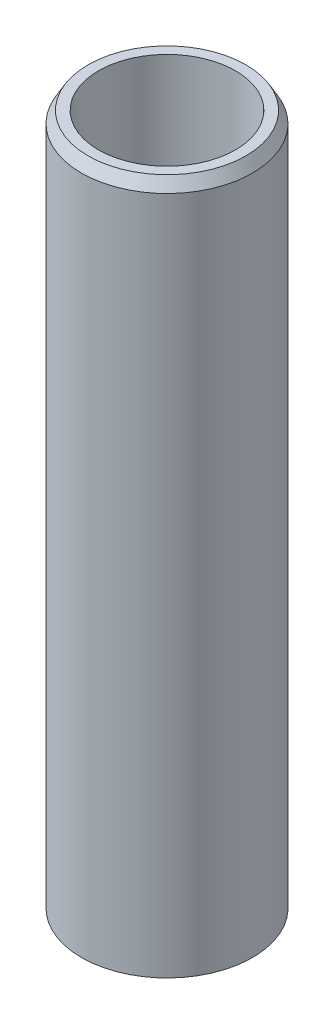
ISO-10303-21;
HEADER;
FILE_DESCRIPTION(('STEP AP214'),'2;1');
FILE_NAME('part.step','',(''),(''),'','','');
FILE_SCHEMA(('AUTOMOTIVE_DESIGN { 1 0 10303 214 1 1 1 1 }'));
ENDSEC;
DATA;
#1=APPLICATION_CONTEXT('core data for automotive mechanical design processes');
#2=APPLICATION_PROTOCOL_DEFINITION('international standard','automotive_design',2000,#1);
#3=PRODUCT_CONTEXT('',#1,'mechanical');
#4=PRODUCT('Part','Part','',(#3));
#5=PRODUCT_RELATED_PRODUCT_CATEGORY('part','',(#4));
#6=PRODUCT_DEFINITION_FORMATION('','',#4);
#7=PRODUCT_DEFINITION_CONTEXT('part definition',#1,'design');
#8=PRODUCT_DEFINITION('design','',#6,#7);
#9=PRODUCT_DEFINITION_SHAPE('','',#8);
#10=(LENGTH_UNIT() NAMED_UNIT(*) SI_UNIT(.MILLI.,.METRE.));
#11=(NAMED_UNIT(*) PLANE_ANGLE_UNIT() SI_UNIT($,.RADIAN.));
#12=(NAMED_UNIT(*) SI_UNIT($,.STERADIAN.) SOLID_ANGLE_UNIT());
#13=UNCERTAINTY_MEASURE_WITH_UNIT(LENGTH_MEASURE(1.E-05),#10,'distance_accuracy_value','');
#14=(GEOMETRIC_REPRESENTATION_CONTEXT(3) GLOBAL_UNCERTAINTY_ASSIGNED_CONTEXT((#13)) GLOBAL_UNIT_ASSIGNED_CONTEXT((#10,
#11,#12)) REPRESENTATION_CONTEXT('',''));
#15=CARTESIAN_POINT('',(0.,0.,0.));
#16=DIRECTION('',(0.,0.,1.));
#17=DIRECTION('',(1.,0.,0.));
#18=AXIS2_PLACEMENT_3D('',#15,#16,#17);
#19=CARTESIAN_POINT('',(0.,224.148766659755,0.));
#20=DIRECTION('',(0.,-1.,0.));
#21=DIRECTION('',(0.,0.,-1.));
#22=AXIS2_PLACEMENT_3D('',#19,#20,#21);
#23=CYLINDRICAL_SURFACE('',#22,27.5);
#24=CARTESIAN_POINT('',(0.,220.432979597929,0.));
#25=DIRECTION('',(0.,1.,0.));
#26=DIRECTION('',(0.,0.,1.));
#27=AXIS2_PLACEMENT_3D('',#24,#25,#26);
#28=CIRCLE('',#27,27.5);
#29=CARTESIAN_POINT('',(0.,220.432979597929,-27.5));
#30=VERTEX_POINT('',#29);
#31=EDGE_CURVE('E50',#30,#30,#28,.F.);
#32=ORIENTED_EDGE('',*,*,#31,.T.);
#33=EDGE_LOOP('',(#32));
#34=FACE_BOUND('',#33,.T.);
#35=CARTESIAN_POINT('',(0.,2.14531066039669,0.));
#36=DIRECTION('',(0.,1.,0.));
#37=DIRECTION('',(0.,0.,1.));
#38=AXIS2_PLACEMENT_3D('',#35,#36,#37);
#39=CIRCLE('',#38,27.5);
#40=CARTESIAN_POINT('',(0.,2.14531066039669,27.5));
#41=VERTEX_POINT('',#40);
#42=EDGE_CURVE('E51',#41,#41,#39,.T.);
#43=ORIENTED_EDGE('',*,*,#42,.T.);
#44=EDGE_LOOP('',(#43));
#45=FACE_BOUND('',#44,.T.);
#46=ADVANCED_FACE('F39',(#34,#45),#23,.T.);
#47=CARTESIAN_POINT('',(0.,224.148766659755,0.));
#48=DIRECTION('',(0.,1.,0.));
#49=DIRECTION('',(0.,0.,1.));
#50=AXIS2_PLACEMENT_3D('',#47,#48,#49);
#51=PLANE('',#50);
#52=CARTESIAN_POINT('',(0.,224.148766659755,0.));
#53=DIRECTION('',(0.,1.,0.));
#54=DIRECTION('',(0.,0.,1.));
#55=AXIS2_PLACEMENT_3D('',#52,#53,#54);
#56=CIRCLE('',#55,25.3546893396034);
#57=CARTESIAN_POINT('',(0.,224.148766659755,-25.3546893396034));
#58=VERTEX_POINT('',#57);
#59=EDGE_CURVE('E54',#58,#58,#56,.T.);
#60=ORIENTED_EDGE('',*,*,#59,.T.);
#61=EDGE_LOOP('',(#60));
#62=FACE_BOUND('',#61,.T.);
#63=CARTESIAN_POINT('',(0.,224.148766659755,0.));
#64=DIRECTION('',(0.,1.,0.));
#65=DIRECTION('',(0.,0.,1.));
#66=AXIS2_PLACEMENT_3D('',#63,#64,#65);
#67=CIRCLE('',#66,22.0198346409254);
#68=CARTESIAN_POINT('',(0.,224.148766659755,22.0198346409254));
#69=VERTEX_POINT('',#68);
#70=EDGE_CURVE('E58',#69,#69,#67,.T.);
#71=ORIENTED_EDGE('',*,*,#70,.F.);
#72=EDGE_LOOP('',(#71));
#73=FACE_BOUND('',#72,.T.);
#74=ADVANCED_FACE('F69',(#62,#73),#51,.T.);
#75=CARTESIAN_POINT('',(0.,0.,0.));
#76=DIRECTION('',(0.,1.,0.));
#77=DIRECTION('',(0.,0.,1.));
#78=AXIS2_PLACEMENT_3D('',#75,#76,#77);
#79=PLANE('',#78);
#80=CARTESIAN_POINT('',(0.,0.,0.));
#81=DIRECTION('',(0.,1.,0.));
#82=DIRECTION('',(0.,0.,1.));
#83=AXIS2_PLACEMENT_3D('',#80,#81,#82);
#84=CIRCLE('',#83,23.7842129381738);
#85=CARTESIAN_POINT('',(0.,0.,23.7842129381738));
#86=VERTEX_POINT('',#85);
#87=EDGE_CURVE('E10',#86,#86,#84,.F.);
#88=ORIENTED_EDGE('',*,*,#87,.T.);
#89=EDGE_LOOP('',(#88));
#90=FACE_BOUND('',#89,.T.);
#91=CARTESIAN_POINT('',(0.,0.,0.));
#92=DIRECTION('',(0.,1.,0.));
#93=DIRECTION('',(0.,0.,1.));
#94=AXIS2_PLACEMENT_3D('',#91,#92,#93);
#95=CIRCLE('',#94,22.0198346409254);
#96=CARTESIAN_POINT('',(0.,0.,22.0198346409254));
#97=VERTEX_POINT('',#96);
#98=EDGE_CURVE('E63',#97,#97,#95,.T.);
#99=ORIENTED_EDGE('',*,*,#98,.T.);
#100=EDGE_LOOP('',(#99));
#101=FACE_BOUND('',#100,.T.);
#102=ADVANCED_FACE('F75',(#90,#101),#79,.F.);
#103=CARTESIAN_POINT('',(0.,224.148766659755,0.));
#104=DIRECTION('',(0.,-1.,0.));
#105=DIRECTION('',(0.,0.,-1.));
#106=AXIS2_PLACEMENT_3D('',#103,#104,#105);
#107=CYLINDRICAL_SURFACE('',#106,22.0198346409254);
#108=ORIENTED_EDGE('',*,*,#70,.T.);
#109=EDGE_LOOP('',(#108));
#110=FACE_BOUND('',#109,.T.);
#111=ORIENTED_EDGE('',*,*,#98,.F.);
#112=EDGE_LOOP('',(#111));
#113=FACE_BOUND('',#112,.T.);
#114=ADVANCED_FACE('F70',(#110,#113),#107,.F.);
#115=CARTESIAN_POINT('',(0.,224.148766659755,0.));
#116=DIRECTION('',(0.,-1.,0.));
#117=DIRECTION('',(0.,0.,-1.));
#118=AXIS2_PLACEMENT_3D('',#115,#116,#117);
#119=CONICAL_SURFACE('',#118,25.3546893396034,0.52359877559829);
#120=CARTESIAN_POINT('',(0.,220.432979597929,-27.5));
#121=CARTESIAN_POINT('',(0.,220.471685713156,-27.4776530139542));
#122=CARTESIAN_POINT('',(0.,220.510391828383,-27.4553060279084));
#123=CARTESIAN_POINT('',(0.,220.587804058838,-27.4106120558168));
#124=CARTESIAN_POINT('',(0.,220.626510174065,-27.388265069771));
#125=CARTESIAN_POINT('',(0.,220.70392240452,-27.3435710976794));
#126=CARTESIAN_POINT('',(0.,220.742628519747,-27.3212241116336));
#127=CARTESIAN_POINT('',(0.,220.820040750202,-27.276530139542));
#128=CARTESIAN_POINT('',(0.,220.85874686543,-27.2541831534962));
#129=CARTESIAN_POINT('',(0.,220.936159095884,-27.2094891814046));
#130=CARTESIAN_POINT('',(0.,220.974865211112,-27.1871421953588));
#131=CARTESIAN_POINT('',(0.,221.052277441566,-27.1424482232672));
#132=CARTESIAN_POINT('',(0.,221.090983556794,-27.1201012372214));
#133=CARTESIAN_POINT('',(0.,221.168395787248,-27.0754072651298));
#134=CARTESIAN_POINT('',(0.,221.207101902476,-27.053060279084));
#135=CARTESIAN_POINT('',(0.,221.28451413293,-27.0083663069924));
#136=CARTESIAN_POINT('',(0.,221.323220248158,-26.9860193209466));
#137=CARTESIAN_POINT('',(0.,221.400632478613,-26.9413253488551));
#138=CARTESIAN_POINT('',(0.,221.43933859384,-26.9189783628093));
#139=CARTESIAN_POINT('',(0.,221.516750824295,-26.8742843907177));
#140=CARTESIAN_POINT('',(0.,221.555456939522,-26.8519374046719));
#141=CARTESIAN_POINT('',(0.,221.632869169977,-26.8072434325803));
#142=CARTESIAN_POINT('',(0.,221.671575285204,-26.7848964465345));
#143=CARTESIAN_POINT('',(0.,221.748987515659,-26.7402024744429));
#144=CARTESIAN_POINT('',(0.,221.787693630886,-26.7178554883971));
#145=CARTESIAN_POINT('',(0.,221.865105861341,-26.6731615163055));
#146=CARTESIAN_POINT('',(0.,221.903811976568,-26.6508145302597));
#147=CARTESIAN_POINT('',(0.,221.981224207023,-26.6061205581681));
#148=CARTESIAN_POINT('',(0.,222.01993032225,-26.5837735721223));
#149=CARTESIAN_POINT('',(0.,222.097342552705,-26.5390796000307));
#150=CARTESIAN_POINT('',(0.,222.136048667932,-26.5167326139849));
#151=CARTESIAN_POINT('',(0.,222.213460898387,-26.4720386418933));
#152=CARTESIAN_POINT('',(0.,222.252167013614,-26.4496916558475));
#153=CARTESIAN_POINT('',(0.,222.329579244069,-26.4049976837559));
#154=CARTESIAN_POINT('',(0.,222.368285359296,-26.3826506977101));
#155=CARTESIAN_POINT('',(0.,222.445697589751,-26.3379567256185));
#156=CARTESIAN_POINT('',(0.,222.484403704979,-26.3156097395727));
#157=CARTESIAN_POINT('',(0.,222.561815935433,-26.2709157674811));
#158=CARTESIAN_POINT('',(0.,222.600522050661,-26.2485687814353));
#159=CARTESIAN_POINT('',(0.,222.677934281115,-26.2038748093437));
#160=CARTESIAN_POINT('',(0.,222.716640396343,-26.1815278232979));
#161=CARTESIAN_POINT('',(0.,222.794052626797,-26.1368338512063));
#162=CARTESIAN_POINT('',(0.,222.832758742025,-26.1144868651605));
#163=CARTESIAN_POINT('',(0.,222.910170972479,-26.0697928930689));
#164=CARTESIAN_POINT('',(0.,222.948877087707,-26.0474459070231));
#165=CARTESIAN_POINT('',(0.,223.026289318162,-26.0027519349315));
#166=CARTESIAN_POINT('',(0.,223.064995433389,-25.9804049488857));
#167=CARTESIAN_POINT('',(0.,223.142407663844,-25.9357109767941));
#168=CARTESIAN_POINT('',(0.,223.181113779071,-25.9133639907483));
#169=CARTESIAN_POINT('',(0.,223.258526009526,-25.8686700186567));
#170=CARTESIAN_POINT('',(0.,223.297232124753,-25.8463230326109));
#171=CARTESIAN_POINT('',(0.,223.374644355208,-25.8016290605193));
#172=CARTESIAN_POINT('',(0.,223.413350470435,-25.7792820744735));
#173=CARTESIAN_POINT('',(0.,223.49076270089,-25.7345881023819));
#174=CARTESIAN_POINT('',(0.,223.529468816117,-25.7122411163361));
#175=CARTESIAN_POINT('',(0.,223.606881046572,-25.6675471442445));
#176=CARTESIAN_POINT('',(0.,223.645587161799,-25.6452001581987));
#177=CARTESIAN_POINT('',(0.,223.722999392254,-25.6005061861072));
#178=CARTESIAN_POINT('',(0.,223.761705507481,-25.5781592000614));
#179=CARTESIAN_POINT('',(0.,223.839117737936,-25.5334652279698));
#180=CARTESIAN_POINT('',(0.,223.877823853163,-25.511118241924));
#181=CARTESIAN_POINT('',(0.,223.955236083618,-25.4664242698324));
#182=CARTESIAN_POINT('',(0.,223.993942198845,-25.4440772837866));
#183=CARTESIAN_POINT('',(0.,224.0713544293,-25.399383311695));
#184=CARTESIAN_POINT('',(0.,224.110060544527,-25.3770363256492));
#185=CARTESIAN_POINT('',(0.,224.148766659755,-25.3546893396034));
#186=B_SPLINE_CURVE_WITH_KNOTS('',3,(#120,#121,#122,#123,#124,#125,#126,#127,#128,#129,#130,
#131,#132,#133,#134,#135,#136,#137,#138,#139,#140,#141,#142,#143,#144,#145,#146,#147,#148,#149,
#150,#151,#152,#153,#154,#155,#156,#157,#158,#159,#160,#161,#162,#163,#164,#165,#166,#167,#168,
#169,#170,#171,#172,#173,#174,#175,#176,#177,#178,#179,#180,#181,#182,#183,#184,#185),
.UNSPECIFIED.,.F.,.F.,(4,2,2,2,2,2,2,2,2,2,2,2,2,2,2,2,2,2,2,2,2,2,2,2,2,2,2,2,2,2,2,2,4),(0.,
0.134081916274788,0.268163832549577,0.402245748824365,0.536327665099154,0.670409581373944,
0.804491497648731,0.938573413923545,1.07265533019833,1.20673724647312,1.34081916274791,
1.4749010790227,1.60898299529749,1.7430649115723,1.87714682784709,2.01122874412188,
2.14531066039667,2.27939257667145,2.41347449294624,2.54755640922103,2.68163832549584,
2.81572024177063,2.94980215804542,3.08388407432021,3.217965990595,3.35204790686979,
3.4861298231446,3.62021173941939,3.75429365569418,3.88837557196897,4.02245748824376,
4.15653940451854,4.29062132079336),.UNSPECIFIED.);
#187=EDGE_CURVE('BSEAM81',#30,#58,#186,.T.);
#188=ORIENTED_EDGE('',*,*,#31,.F.);
#189=ORIENTED_EDGE('',*,*,#59,.F.);
#190=ORIENTED_EDGE('',*,*,#187,.T.);
#191=ORIENTED_EDGE('',*,*,#187,.F.);
#192=EDGE_LOOP('',(#188,#190,#189,#191));
#193=FACE_BOUND('',#192,.T.);
#194=ADVANCED_FACE('F81',(#193),#119,.T.);
#195=CARTESIAN_POINT('',(0.,2.14531066039669,0.));
#196=DIRECTION('',(0.,1.,0.));
#197=DIRECTION('',(0.,0.,1.));
#198=AXIS2_PLACEMENT_3D('',#195,#196,#197);
#199=CONICAL_SURFACE('',#198,27.5,1.0471975511966);
#200=ORIENTED_EDGE('',*,*,#87,.F.);
#201=EDGE_LOOP('',(#200));
#202=FACE_BOUND('',#201,.T.);
#203=ORIENTED_EDGE('',*,*,#42,.F.);
#204=EDGE_LOOP('',(#203));
#205=FACE_BOUND('',#204,.T.);
#206=ADVANCED_FACE('F45',(#202,#205),#199,.T.);
#207=CLOSED_SHELL('',(#46,#74,#102,#114,#194,#206));
#208=MANIFOLD_SOLID_BREP('B2',#207);
#209=ADVANCED_BREP_SHAPE_REPRESENTATION('',(#18,#208),#14);
#210=SHAPE_DEFINITION_REPRESENTATION(#9,#209);
ENDSEC;
END-ISO-10303-21;
